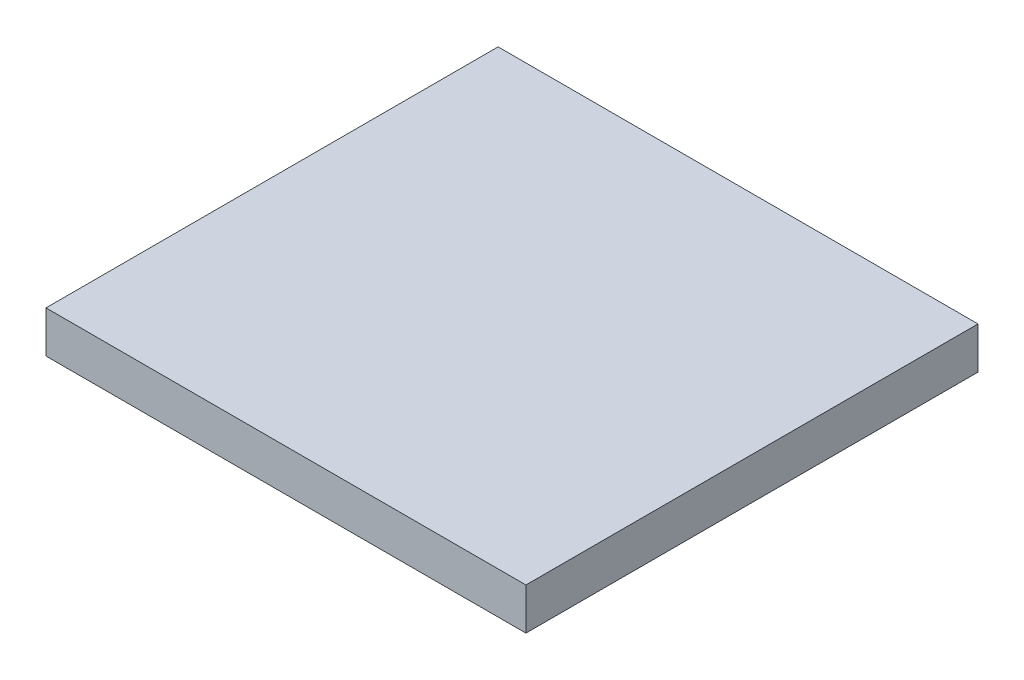
ISO-10303-21;
HEADER;
FILE_DESCRIPTION(('STEP AP214'),'2;1');
FILE_NAME('part.step','',(''),(''),'','','');
FILE_SCHEMA(('AUTOMOTIVE_DESIGN { 1 0 10303 214 1 1 1 1 }'));
ENDSEC;
DATA;
#1=APPLICATION_CONTEXT('core data for automotive mechanical design processes');
#2=APPLICATION_PROTOCOL_DEFINITION('international standard','automotive_design',2000,#1);
#3=PRODUCT_CONTEXT('',#1,'mechanical');
#4=PRODUCT('Part','Part','',(#3));
#5=PRODUCT_RELATED_PRODUCT_CATEGORY('part','',(#4));
#6=PRODUCT_DEFINITION_FORMATION('','',#4);
#7=PRODUCT_DEFINITION_CONTEXT('part definition',#1,'design');
#8=PRODUCT_DEFINITION('design','',#6,#7);
#9=PRODUCT_DEFINITION_SHAPE('','',#8);
#10=(LENGTH_UNIT() NAMED_UNIT(*) SI_UNIT(.MILLI.,.METRE.));
#11=(NAMED_UNIT(*) PLANE_ANGLE_UNIT() SI_UNIT($,.RADIAN.));
#12=(NAMED_UNIT(*) SI_UNIT($,.STERADIAN.) SOLID_ANGLE_UNIT());
#13=UNCERTAINTY_MEASURE_WITH_UNIT(LENGTH_MEASURE(1.E-05),#10,'distance_accuracy_value','');
#14=(GEOMETRIC_REPRESENTATION_CONTEXT(3) GLOBAL_UNCERTAINTY_ASSIGNED_CONTEXT((#13)) GLOBAL_UNIT_ASSIGNED_CONTEXT((#10,
#11,#12)) REPRESENTATION_CONTEXT('',''));
#15=CARTESIAN_POINT('',(0.,0.,0.));
#16=DIRECTION('',(0.,0.,1.));
#17=DIRECTION('',(1.,0.,0.));
#18=AXIS2_PLACEMENT_3D('',#15,#16,#17);
#19=CARTESIAN_POINT('',(-8.4713614625889,3.,35.9205857730197));
#20=DIRECTION('',(1.,0.,0.));
#21=DIRECTION('',(0.,0.,-1.));
#22=AXIS2_PLACEMENT_3D('',#19,#20,#21);
#23=PLANE('',#22);
#24=DIRECTION('',(0.,0.,1.));
#25=VECTOR('',#24,1.);
#26=CARTESIAN_POINT('',(-8.4713614625889,0.,35.9205857730197));
#27=LINE('',#26,#25);
#28=CARTESIAN_POINT('',(-8.4713614625889,0.,3.42058577301971));
#29=VERTEX_POINT('',#28);
#30=CARTESIAN_POINT('',(-8.4713614625889,0.,35.9205857730197));
#31=VERTEX_POINT('',#30);
#32=EDGE_CURVE('E96',#29,#31,#27,.T.);
#33=ORIENTED_EDGE('',*,*,#32,.T.);
#34=DIRECTION('',(0.,-1.,0.));
#35=VECTOR('',#34,1.);
#36=CARTESIAN_POINT('',(-8.4713614625889,3.,35.9205857730197));
#37=LINE('',#36,#35);
#38=CARTESIAN_POINT('',(-8.4713614625889,3.,35.9205857730197));
#39=VERTEX_POINT('',#38);
#40=EDGE_CURVE('E11',#39,#31,#37,.T.);
#41=ORIENTED_EDGE('',*,*,#40,.F.);
#42=DIRECTION('',(0.,0.,1.));
#43=VECTOR('',#42,1.);
#44=CARTESIAN_POINT('',(-8.4713614625889,3.,35.9205857730197));
#45=LINE('',#44,#43);
#46=CARTESIAN_POINT('',(-8.4713614625889,3.,3.42058577301971));
#47=VERTEX_POINT('',#46);
#48=EDGE_CURVE('E84',#47,#39,#45,.T.);
#49=ORIENTED_EDGE('',*,*,#48,.F.);
#50=DIRECTION('',(0.,-1.,0.));
#51=VECTOR('',#50,1.);
#52=CARTESIAN_POINT('',(-8.4713614625889,3.,3.42058577301971));
#53=LINE('',#52,#51);
#54=EDGE_CURVE('E92',#47,#29,#53,.T.);
#55=ORIENTED_EDGE('',*,*,#54,.T.);
#56=EDGE_LOOP('',(#33,#41,#49,#55));
#57=FACE_BOUND('',#56,.T.);
#58=ADVANCED_FACE('F33',(#57),#23,.F.);
#59=CARTESIAN_POINT('',(26.0286385374111,3.,35.9205857730197));
#60=DIRECTION('',(0.,0.,-1.));
#61=DIRECTION('',(-1.,0.,0.));
#62=AXIS2_PLACEMENT_3D('',#59,#60,#61);
#63=PLANE('',#62);
#64=DIRECTION('',(1.,0.,0.));
#65=VECTOR('',#64,1.);
#66=CARTESIAN_POINT('',(26.0286385374111,0.,35.9205857730197));
#67=LINE('',#66,#65);
#68=CARTESIAN_POINT('',(26.0286385374111,0.,35.9205857730197));
#69=VERTEX_POINT('',#68);
#70=EDGE_CURVE('E88',#31,#69,#67,.T.);
#71=ORIENTED_EDGE('',*,*,#70,.T.);
#72=DIRECTION('',(0.,-1.,0.));
#73=VECTOR('',#72,1.);
#74=CARTESIAN_POINT('',(26.0286385374111,3.,35.9205857730197));
#75=LINE('',#74,#73);
#76=CARTESIAN_POINT('',(26.0286385374111,3.,35.9205857730197));
#77=VERTEX_POINT('',#76);
#78=EDGE_CURVE('E41',#77,#69,#75,.T.);
#79=ORIENTED_EDGE('',*,*,#78,.F.);
#80=DIRECTION('',(1.,0.,0.));
#81=VECTOR('',#80,1.);
#82=CARTESIAN_POINT('',(26.0286385374111,3.,35.9205857730197));
#83=LINE('',#82,#81);
#84=EDGE_CURVE('E79',#39,#77,#83,.T.);
#85=ORIENTED_EDGE('',*,*,#84,.F.);
#86=ORIENTED_EDGE('',*,*,#40,.T.);
#87=EDGE_LOOP('',(#71,#79,#85,#86));
#88=FACE_BOUND('',#87,.T.);
#89=ADVANCED_FACE('F87',(#88),#63,.F.);
#90=CARTESIAN_POINT('',(26.0286385374111,3.,3.42058577301971));
#91=DIRECTION('',(-1.,0.,0.));
#92=DIRECTION('',(0.,0.,1.));
#93=AXIS2_PLACEMENT_3D('',#90,#91,#92);
#94=PLANE('',#93);
#95=DIRECTION('',(0.,0.,-1.));
#96=VECTOR('',#95,1.);
#97=CARTESIAN_POINT('',(26.0286385374111,0.,3.42058577301971));
#98=LINE('',#97,#96);
#99=CARTESIAN_POINT('',(26.0286385374111,0.,3.42058577301971));
#100=VERTEX_POINT('',#99);
#101=EDGE_CURVE('E66',#69,#100,#98,.T.);
#102=ORIENTED_EDGE('',*,*,#101,.T.);
#103=DIRECTION('',(0.,-1.,0.));
#104=VECTOR('',#103,1.);
#105=CARTESIAN_POINT('',(26.0286385374111,3.,3.42058577301971));
#106=LINE('',#105,#104);
#107=CARTESIAN_POINT('',(26.0286385374111,3.,3.42058577301971));
#108=VERTEX_POINT('',#107);
#109=EDGE_CURVE('E89',#108,#100,#106,.T.);
#110=ORIENTED_EDGE('',*,*,#109,.F.);
#111=DIRECTION('',(0.,0.,-1.));
#112=VECTOR('',#111,1.);
#113=CARTESIAN_POINT('',(26.0286385374111,3.,3.42058577301971));
#114=LINE('',#113,#112);
#115=EDGE_CURVE('E82',#77,#108,#114,.T.);
#116=ORIENTED_EDGE('',*,*,#115,.F.);
#117=ORIENTED_EDGE('',*,*,#78,.T.);
#118=EDGE_LOOP('',(#102,#110,#116,#117));
#119=FACE_BOUND('',#118,.T.);
#120=ADVANCED_FACE('F90',(#119),#94,.F.);
#121=CARTESIAN_POINT('',(-8.4713614625889,3.,3.42058577301971));
#122=DIRECTION('',(0.,0.,1.));
#123=DIRECTION('',(1.,0.,0.));
#124=AXIS2_PLACEMENT_3D('',#121,#122,#123);
#125=PLANE('',#124);
#126=DIRECTION('',(-1.,0.,0.));
#127=VECTOR('',#126,1.);
#128=CARTESIAN_POINT('',(-8.4713614625889,0.,3.42058577301971));
#129=LINE('',#128,#127);
#130=EDGE_CURVE('E72',#100,#29,#129,.T.);
#131=ORIENTED_EDGE('',*,*,#130,.T.);
#132=ORIENTED_EDGE('',*,*,#54,.F.);
#133=DIRECTION('',(-1.,0.,0.));
#134=VECTOR('',#133,1.);
#135=CARTESIAN_POINT('',(-8.4713614625889,3.,3.42058577301971));
#136=LINE('',#135,#134);
#137=EDGE_CURVE('E49',#108,#47,#136,.T.);
#138=ORIENTED_EDGE('',*,*,#137,.F.);
#139=ORIENTED_EDGE('',*,*,#109,.T.);
#140=EDGE_LOOP('',(#131,#132,#138,#139));
#141=FACE_BOUND('',#140,.T.);
#142=ADVANCED_FACE('F103',(#141),#125,.F.);
#143=CARTESIAN_POINT('',(0.,3.,0.));
#144=DIRECTION('',(0.,-1.,0.));
#145=DIRECTION('',(0.,0.,-1.));
#146=AXIS2_PLACEMENT_3D('',#143,#144,#145);
#147=PLANE('',#146);
#148=ORIENTED_EDGE('',*,*,#48,.T.);
#149=ORIENTED_EDGE('',*,*,#84,.T.);
#150=ORIENTED_EDGE('',*,*,#115,.T.);
#151=ORIENTED_EDGE('',*,*,#137,.T.);
#152=EDGE_LOOP('',(#148,#149,#150,#151));
#153=FACE_BOUND('',#152,.T.);
#154=ADVANCED_FACE('F80',(#153),#147,.F.);
#155=CARTESIAN_POINT('',(0.,0.,0.));
#156=DIRECTION('',(0.,-1.,0.));
#157=DIRECTION('',(0.,0.,-1.));
#158=AXIS2_PLACEMENT_3D('',#155,#156,#157);
#159=PLANE('',#158);
#160=ORIENTED_EDGE('',*,*,#32,.F.);
#161=ORIENTED_EDGE('',*,*,#130,.F.);
#162=ORIENTED_EDGE('',*,*,#101,.F.);
#163=ORIENTED_EDGE('',*,*,#70,.F.);
#164=EDGE_LOOP('',(#160,#161,#162,#163));
#165=FACE_BOUND('',#164,.T.);
#166=ADVANCED_FACE('F106',(#165),#159,.T.);
#167=CLOSED_SHELL('',(#58,#89,#120,#142,#154,#166));
#168=MANIFOLD_SOLID_BREP('B2',#167);
#169=ADVANCED_BREP_SHAPE_REPRESENTATION('',(#18,#168),#14);
#170=SHAPE_DEFINITION_REPRESENTATION(#9,#169);
ENDSEC;
END-ISO-10303-21;
